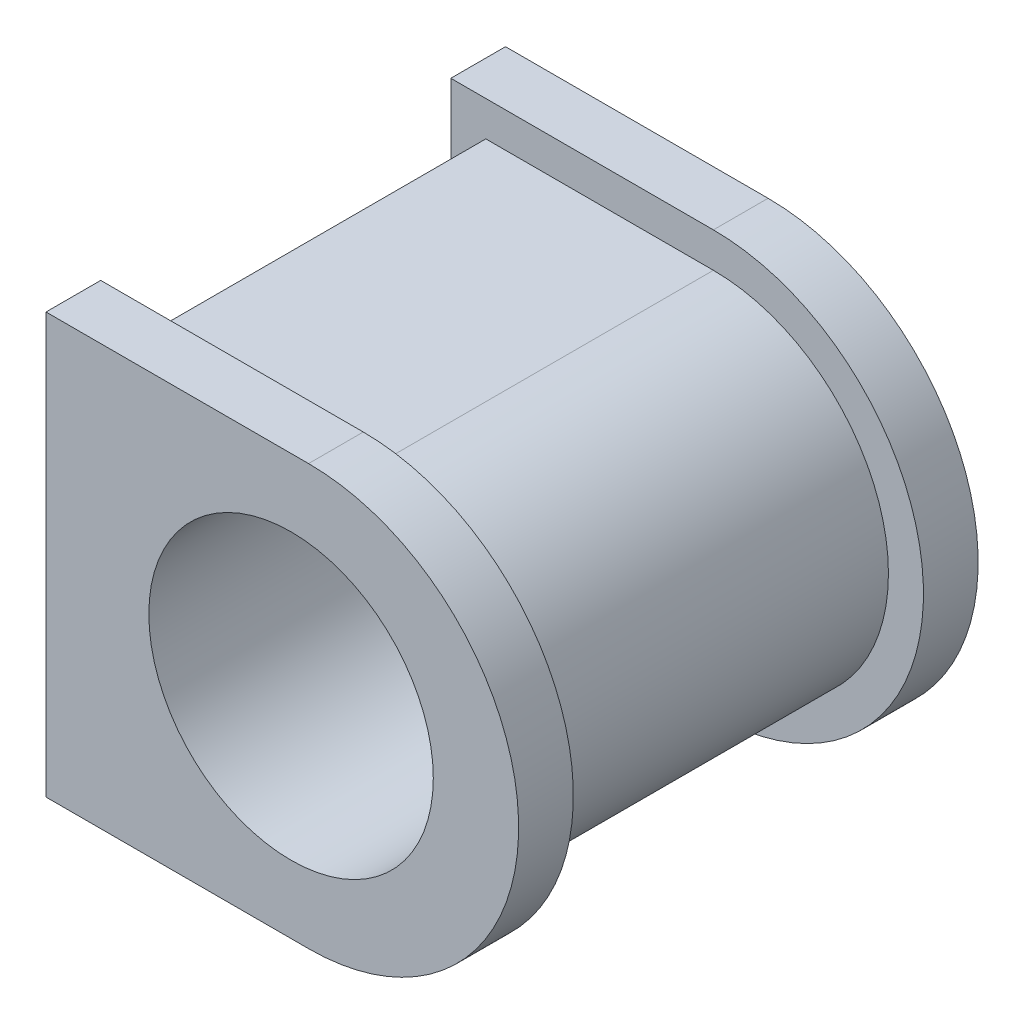
ISO-10303-21;
HEADER;
FILE_DESCRIPTION(('STEP AP214'),'2;1');
FILE_NAME('part.step','',(''),(''),'','','');
FILE_SCHEMA(('AUTOMOTIVE_DESIGN { 1 0 10303 214 1 1 1 1 }'));
ENDSEC;
DATA;
#1=APPLICATION_CONTEXT('core data for automotive mechanical design processes');
#2=APPLICATION_PROTOCOL_DEFINITION('international standard','automotive_design',2000,#1);
#3=PRODUCT_CONTEXT('',#1,'mechanical');
#4=PRODUCT('Part','Part','',(#3));
#5=PRODUCT_RELATED_PRODUCT_CATEGORY('part','',(#4));
#6=PRODUCT_DEFINITION_FORMATION('','',#4);
#7=PRODUCT_DEFINITION_CONTEXT('part definition',#1,'design');
#8=PRODUCT_DEFINITION('design','',#6,#7);
#9=PRODUCT_DEFINITION_SHAPE('','',#8);
#10=(LENGTH_UNIT() NAMED_UNIT(*) SI_UNIT(.MILLI.,.METRE.));
#11=(NAMED_UNIT(*) PLANE_ANGLE_UNIT() SI_UNIT($,.RADIAN.));
#12=(NAMED_UNIT(*) SI_UNIT($,.STERADIAN.) SOLID_ANGLE_UNIT());
#13=UNCERTAINTY_MEASURE_WITH_UNIT(LENGTH_MEASURE(1.E-05),#10,'distance_accuracy_value','');
#14=(GEOMETRIC_REPRESENTATION_CONTEXT(3) GLOBAL_UNCERTAINTY_ASSIGNED_CONTEXT((#13)) GLOBAL_UNIT_ASSIGNED_CONTEXT((#10,
#11,#12)) REPRESENTATION_CONTEXT('',''));
#15=CARTESIAN_POINT('',(0.,0.,0.));
#16=DIRECTION('',(0.,0.,1.));
#17=DIRECTION('',(1.,0.,0.));
#18=AXIS2_PLACEMENT_3D('',#15,#16,#17);
#19=CARTESIAN_POINT('',(-225.792643224085,137.875019839072,80.));
#20=DIRECTION('',(1.,0.,0.));
#21=DIRECTION('',(0.,0.,-1.));
#22=AXIS2_PLACEMENT_3D('',#19,#20,#21);
#23=PLANE('',#22);
#24=DIRECTION('',(0.,-1.,0.));
#25=VECTOR('',#24,1.);
#26=CARTESIAN_POINT('',(-225.792643224085,137.875019839072,0.));
#27=LINE('',#26,#25);
#28=CARTESIAN_POINT('',(-225.792643224085,137.875019839072,0.));
#29=VERTEX_POINT('',#28);
#30=CARTESIAN_POINT('',(-225.792643224085,57.8750198390718,0.));
#31=VERTEX_POINT('',#30);
#32=EDGE_CURVE('E184',#29,#31,#27,.T.);
#33=ORIENTED_EDGE('',*,*,#32,.T.);
#34=DIRECTION('',(0.,0.,-1.));
#35=VECTOR('',#34,1.);
#36=CARTESIAN_POINT('',(-225.792643224085,57.8750198390718,80.));
#37=LINE('',#36,#35);
#38=CARTESIAN_POINT('',(-225.792643224085,57.8750198390718,80.));
#39=VERTEX_POINT('',#38);
#40=EDGE_CURVE('E11',#39,#31,#37,.T.);
#41=ORIENTED_EDGE('',*,*,#40,.F.);
#42=DIRECTION('',(0.,-1.,0.));
#43=VECTOR('',#42,1.);
#44=CARTESIAN_POINT('',(-225.792643224085,137.875019839072,80.));
#45=LINE('',#44,#43);
#46=CARTESIAN_POINT('',(-225.792643224085,137.875019839072,80.));
#47=VERTEX_POINT('',#46);
#48=EDGE_CURVE('E185',#47,#39,#45,.T.);
#49=ORIENTED_EDGE('',*,*,#48,.F.);
#50=DIRECTION('',(0.,0.,-1.));
#51=VECTOR('',#50,1.);
#52=CARTESIAN_POINT('',(-225.792643224085,137.875019839072,80.));
#53=LINE('',#52,#51);
#54=EDGE_CURVE('E198',#47,#29,#53,.T.);
#55=ORIENTED_EDGE('',*,*,#54,.T.);
#56=EDGE_LOOP('',(#33,#41,#49,#55));
#57=FACE_BOUND('',#56,.T.);
#58=ADVANCED_FACE('F36',(#57),#23,.F.);
#59=CARTESIAN_POINT('',(-225.792643224085,57.8750198390718,80.));
#60=DIRECTION('',(0.,1.,0.));
#61=DIRECTION('',(0.,0.,1.));
#62=AXIS2_PLACEMENT_3D('',#59,#60,#61);
#63=PLANE('',#62);
#64=DIRECTION('',(1.,0.,0.));
#65=VECTOR('',#64,1.);
#66=CARTESIAN_POINT('',(-225.792643224085,57.8750198390718,0.));
#67=LINE('',#66,#65);
#68=CARTESIAN_POINT('',(-173.792643224085,57.8750198390718,0.));
#69=VERTEX_POINT('',#68);
#70=EDGE_CURVE('E201',#31,#69,#67,.T.);
#71=ORIENTED_EDGE('',*,*,#70,.T.);
#72=DIRECTION('',(0.,0.,-1.));
#73=VECTOR('',#72,1.);
#74=CARTESIAN_POINT('',(-173.792643224085,57.8750198390718,80.));
#75=LINE('',#74,#73);
#76=CARTESIAN_POINT('',(-173.792643224085,57.8750198390718,80.));
#77=VERTEX_POINT('',#76);
#78=EDGE_CURVE('E44',#77,#69,#75,.T.);
#79=ORIENTED_EDGE('',*,*,#78,.F.);
#80=DIRECTION('',(1.,0.,0.));
#81=VECTOR('',#80,1.);
#82=CARTESIAN_POINT('',(-225.792643224085,57.8750198390718,80.));
#83=LINE('',#82,#81);
#84=EDGE_CURVE('E188',#39,#77,#83,.T.);
#85=ORIENTED_EDGE('',*,*,#84,.F.);
#86=ORIENTED_EDGE('',*,*,#40,.T.);
#87=EDGE_LOOP('',(#71,#79,#85,#86));
#88=FACE_BOUND('',#87,.T.);
#89=ADVANCED_FACE('F214',(#88),#63,.F.);
#90=CARTESIAN_POINT('',(-173.792643224085,97.8750198390718,80.));
#91=DIRECTION('',(0.,0.,-1.));
#92=DIRECTION('',(-1.,0.,0.));
#93=AXIS2_PLACEMENT_3D('',#90,#91,#92);
#94=CYLINDRICAL_SURFACE('',#93,40.);
#95=CARTESIAN_POINT('',(-173.792643224085,97.8750198390718,0.));
#96=DIRECTION('',(0.,0.,1.));
#97=DIRECTION('',(1.,0.,0.));
#98=AXIS2_PLACEMENT_3D('',#95,#96,#97);
#99=CIRCLE('',#98,40.);
#100=CARTESIAN_POINT('',(-173.792643224085,137.875019839072,0.));
#101=VERTEX_POINT('',#100);
#102=EDGE_CURVE('E204',#69,#101,#99,.T.);
#103=ORIENTED_EDGE('',*,*,#102,.T.);
#104=DIRECTION('',(0.,0.,-1.));
#105=VECTOR('',#104,1.);
#106=CARTESIAN_POINT('',(-173.792643224085,137.875019839072,80.));
#107=LINE('',#106,#105);
#108=CARTESIAN_POINT('',(-173.792643224085,137.875019839072,80.));
#109=VERTEX_POINT('',#108);
#110=EDGE_CURVE('E51',#109,#101,#107,.T.);
#111=ORIENTED_EDGE('',*,*,#110,.F.);
#112=CARTESIAN_POINT('',(-173.792643224085,97.8750198390718,80.));
#113=DIRECTION('',(0.,0.,1.));
#114=DIRECTION('',(1.,0.,0.));
#115=AXIS2_PLACEMENT_3D('',#112,#113,#114);
#116=CIRCLE('',#115,40.);
#117=EDGE_CURVE('E192',#77,#109,#116,.T.);
#118=ORIENTED_EDGE('',*,*,#117,.F.);
#119=ORIENTED_EDGE('',*,*,#78,.T.);
#120=EDGE_LOOP('',(#103,#111,#118,#119));
#121=FACE_BOUND('',#120,.T.);
#122=ADVANCED_FACE('F211',(#121),#94,.T.);
#123=CARTESIAN_POINT('',(-225.792643224085,137.875019839072,80.));
#124=DIRECTION('',(0.,-1.,0.));
#125=DIRECTION('',(0.,0.,-1.));
#126=AXIS2_PLACEMENT_3D('',#123,#124,#125);
#127=PLANE('',#126);
#128=DIRECTION('',(-1.,0.,0.));
#129=VECTOR('',#128,1.);
#130=CARTESIAN_POINT('',(-225.792643224085,137.875019839072,0.));
#131=LINE('',#130,#129);
#132=EDGE_CURVE('E189',#101,#29,#131,.T.);
#133=ORIENTED_EDGE('',*,*,#132,.T.);
#134=ORIENTED_EDGE('',*,*,#54,.F.);
#135=DIRECTION('',(-1.,0.,0.));
#136=VECTOR('',#135,1.);
#137=CARTESIAN_POINT('',(-225.792643224085,137.875019839072,80.));
#138=LINE('',#137,#136);
#139=EDGE_CURVE('E195',#109,#47,#138,.T.);
#140=ORIENTED_EDGE('',*,*,#139,.F.);
#141=ORIENTED_EDGE('',*,*,#110,.T.);
#142=EDGE_LOOP('',(#133,#134,#140,#141));
#143=FACE_BOUND('',#142,.T.);
#144=ADVANCED_FACE('F221',(#143),#127,.F.);
#145=CARTESIAN_POINT('',(-177.792643224085,97.8750198390718,80.));
#146=DIRECTION('',(0.,0.,-1.));
#147=DIRECTION('',(-1.,0.,0.));
#148=AXIS2_PLACEMENT_3D('',#145,#146,#147);
#149=CYLINDRICAL_SURFACE('',#148,32.5);
#150=CARTESIAN_POINT('',(-177.792643224085,97.8750198390718,92.5));
#151=DIRECTION('',(0.,0.,1.));
#152=DIRECTION('',(1.,0.,0.));
#153=AXIS2_PLACEMENT_3D('',#150,#151,#152);
#154=CIRCLE('',#153,32.5);
#155=CARTESIAN_POINT('',(-145.292643224085,97.8750198390718,92.5));
#156=VERTEX_POINT('',#155);
#157=EDGE_CURVE('E166',#156,#156,#154,.F.);
#158=ORIENTED_EDGE('',*,*,#157,.F.);
#159=EDGE_LOOP('',(#158));
#160=FACE_BOUND('',#159,.T.);
#161=CARTESIAN_POINT('',(-177.792643224085,97.8750198390718,-12.5));
#162=DIRECTION('',(0.,0.,-1.));
#163=DIRECTION('',(-1.,0.,0.));
#164=AXIS2_PLACEMENT_3D('',#161,#162,#163);
#165=CIRCLE('',#164,32.5);
#166=CARTESIAN_POINT('',(-210.292643224085,97.8750198390718,-12.5));
#167=VERTEX_POINT('',#166);
#168=EDGE_CURVE('E282',#167,#167,#165,.T.);
#169=ORIENTED_EDGE('',*,*,#168,.T.);
#170=EDGE_LOOP('',(#169));
#171=FACE_BOUND('',#170,.T.);
#172=ADVANCED_FACE('F227',(#160,#171),#149,.F.);
#173=CARTESIAN_POINT('',(0.,0.,80.));
#174=DIRECTION('',(0.,0.,1.));
#175=DIRECTION('',(1.,0.,0.));
#176=AXIS2_PLACEMENT_3D('',#173,#174,#175);
#177=PLANE('',#176);
#178=DIRECTION('',(-1.,0.,0.));
#179=VECTOR('',#178,1.);
#180=CARTESIAN_POINT('',(0.,49.8750198390718,80.));
#181=LINE('',#180,#179);
#182=CARTESIAN_POINT('',(-173.792643224085,49.8750198390718,80.));
#183=VERTEX_POINT('',#182);
#184=CARTESIAN_POINT('',(-233.792643224085,49.8750198390718,80.));
#185=VERTEX_POINT('',#184);
#186=EDGE_CURVE('E147',#183,#185,#181,.T.);
#187=ORIENTED_EDGE('',*,*,#186,.T.);
#188=DIRECTION('',(0.,-1.,0.));
#189=VECTOR('',#188,1.);
#190=CARTESIAN_POINT('',(-233.792643224085,0.,80.));
#191=LINE('',#190,#189);
#192=CARTESIAN_POINT('',(-233.792643224085,145.875019839072,80.));
#193=VERTEX_POINT('',#192);
#194=EDGE_CURVE('E160',#193,#185,#191,.T.);
#195=ORIENTED_EDGE('',*,*,#194,.F.);
#196=DIRECTION('',(-1.,0.,0.));
#197=VECTOR('',#196,1.);
#198=CARTESIAN_POINT('',(0.,145.875019839072,80.));
#199=LINE('',#198,#197);
#200=CARTESIAN_POINT('',(-173.792643224085,145.875019839072,80.));
#201=VERTEX_POINT('',#200);
#202=EDGE_CURVE('E171',#201,#193,#199,.T.);
#203=ORIENTED_EDGE('',*,*,#202,.F.);
#204=CARTESIAN_POINT('',(-173.792643224085,97.8750198390718,80.));
#205=DIRECTION('',(0.,0.,1.));
#206=DIRECTION('',(1.,0.,0.));
#207=AXIS2_PLACEMENT_3D('',#204,#205,#206);
#208=CIRCLE('',#207,48.);
#209=EDGE_CURVE('E150',#183,#201,#208,.T.);
#210=ORIENTED_EDGE('',*,*,#209,.F.);
#211=EDGE_LOOP('',(#187,#195,#203,#210));
#212=FACE_BOUND('',#211,.T.);
#213=ORIENTED_EDGE('',*,*,#139,.T.);
#214=ORIENTED_EDGE('',*,*,#48,.T.);
#215=ORIENTED_EDGE('',*,*,#84,.T.);
#216=ORIENTED_EDGE('',*,*,#117,.T.);
#217=EDGE_LOOP('',(#213,#214,#215,#216));
#218=FACE_BOUND('',#217,.T.);
#219=ADVANCED_FACE('F224',(#212,#218),#177,.F.);
#220=CARTESIAN_POINT('',(0.,49.8750198390718,92.5));
#221=DIRECTION('',(0.,-1.,0.));
#222=DIRECTION('',(1.,0.,0.));
#223=AXIS2_PLACEMENT_3D('',#220,#221,#222);
#224=PLANE('',#223);
#225=ORIENTED_EDGE('',*,*,#186,.F.);
#226=DIRECTION('',(0.,0.,-1.));
#227=VECTOR('',#226,1.);
#228=CARTESIAN_POINT('',(-173.792643224085,49.8750198390718,92.5));
#229=LINE('',#228,#227);
#230=CARTESIAN_POINT('',(-173.792643224085,49.8750198390718,92.5));
#231=VERTEX_POINT('',#230);
#232=EDGE_CURVE('E182',#231,#183,#229,.T.);
#233=ORIENTED_EDGE('',*,*,#232,.F.);
#234=DIRECTION('',(-1.,0.,0.));
#235=VECTOR('',#234,1.);
#236=CARTESIAN_POINT('',(0.,49.8750198390718,92.5));
#237=LINE('',#236,#235);
#238=CARTESIAN_POINT('',(-233.792643224085,49.8750198390718,92.5));
#239=VERTEX_POINT('',#238);
#240=EDGE_CURVE('E156',#231,#239,#237,.T.);
#241=ORIENTED_EDGE('',*,*,#240,.T.);
#242=DIRECTION('',(0.,0.,-1.));
#243=VECTOR('',#242,1.);
#244=CARTESIAN_POINT('',(-233.792643224085,49.8750198390718,92.5));
#245=LINE('',#244,#243);
#246=EDGE_CURVE('E168',#239,#185,#245,.T.);
#247=ORIENTED_EDGE('',*,*,#246,.T.);
#248=EDGE_LOOP('',(#225,#233,#241,#247));
#249=FACE_BOUND('',#248,.T.);
#250=ADVANCED_FACE('F226',(#249),#224,.T.);
#251=CARTESIAN_POINT('',(-173.792643224085,97.8750198390718,92.5));
#252=DIRECTION('',(0.,0.,-1.));
#253=DIRECTION('',(-1.,0.,0.));
#254=AXIS2_PLACEMENT_3D('',#251,#252,#253);
#255=CYLINDRICAL_SURFACE('',#254,48.);
#256=ORIENTED_EDGE('',*,*,#209,.T.);
#257=DIRECTION('',(0.,0.,-1.));
#258=VECTOR('',#257,1.);
#259=CARTESIAN_POINT('',(-173.792643224085,145.875019839072,92.5));
#260=LINE('',#259,#258);
#261=CARTESIAN_POINT('',(-173.792643224085,145.875019839072,92.5));
#262=VERTEX_POINT('',#261);
#263=EDGE_CURVE('E179',#262,#201,#260,.T.);
#264=ORIENTED_EDGE('',*,*,#263,.F.);
#265=CARTESIAN_POINT('',(-173.792643224085,97.8750198390718,92.5));
#266=DIRECTION('',(0.,0.,1.));
#267=DIRECTION('',(1.,0.,0.));
#268=AXIS2_PLACEMENT_3D('',#265,#266,#267);
#269=CIRCLE('',#268,48.);
#270=EDGE_CURVE('E159',#231,#262,#269,.T.);
#271=ORIENTED_EDGE('',*,*,#270,.F.);
#272=ORIENTED_EDGE('',*,*,#232,.T.);
#273=EDGE_LOOP('',(#256,#264,#271,#272));
#274=FACE_BOUND('',#273,.T.);
#275=ADVANCED_FACE('F234',(#274),#255,.T.);
#276=CARTESIAN_POINT('',(0.,145.875019839072,92.5));
#277=DIRECTION('',(0.,-1.,0.));
#278=DIRECTION('',(1.,0.,0.));
#279=AXIS2_PLACEMENT_3D('',#276,#277,#278);
#280=PLANE('',#279);
#281=ORIENTED_EDGE('',*,*,#202,.T.);
#282=DIRECTION('',(0.,0.,-1.));
#283=VECTOR('',#282,1.);
#284=CARTESIAN_POINT('',(-233.792643224085,145.875019839072,92.5));
#285=LINE('',#284,#283);
#286=CARTESIAN_POINT('',(-233.792643224085,145.875019839072,92.5));
#287=VERTEX_POINT('',#286);
#288=EDGE_CURVE('E176',#287,#193,#285,.T.);
#289=ORIENTED_EDGE('',*,*,#288,.F.);
#290=DIRECTION('',(-1.,0.,0.));
#291=VECTOR('',#290,1.);
#292=CARTESIAN_POINT('',(0.,145.875019839072,92.5));
#293=LINE('',#292,#291);
#294=EDGE_CURVE('E162',#262,#287,#293,.T.);
#295=ORIENTED_EDGE('',*,*,#294,.F.);
#296=ORIENTED_EDGE('',*,*,#263,.T.);
#297=EDGE_LOOP('',(#281,#289,#295,#296));
#298=FACE_BOUND('',#297,.T.);
#299=ADVANCED_FACE('F254',(#298),#280,.F.);
#300=CARTESIAN_POINT('',(-233.792643224085,0.,92.5));
#301=DIRECTION('',(1.,0.,0.));
#302=DIRECTION('',(0.,0.,-1.));
#303=AXIS2_PLACEMENT_3D('',#300,#301,#302);
#304=PLANE('',#303);
#305=ORIENTED_EDGE('',*,*,#194,.T.);
#306=ORIENTED_EDGE('',*,*,#246,.F.);
#307=DIRECTION('',(0.,-1.,0.));
#308=VECTOR('',#307,1.);
#309=CARTESIAN_POINT('',(-233.792643224085,0.,92.5));
#310=LINE('',#309,#308);
#311=EDGE_CURVE('E164',#287,#239,#310,.T.);
#312=ORIENTED_EDGE('',*,*,#311,.F.);
#313=ORIENTED_EDGE('',*,*,#288,.T.);
#314=EDGE_LOOP('',(#305,#306,#312,#313));
#315=FACE_BOUND('',#314,.T.);
#316=ADVANCED_FACE('F257',(#315),#304,.F.);
#317=CARTESIAN_POINT('',(0.,0.,92.5));
#318=DIRECTION('',(0.,0.,1.));
#319=DIRECTION('',(1.,0.,0.));
#320=AXIS2_PLACEMENT_3D('',#317,#318,#319);
#321=PLANE('',#320);
#322=ORIENTED_EDGE('',*,*,#240,.F.);
#323=ORIENTED_EDGE('',*,*,#270,.T.);
#324=ORIENTED_EDGE('',*,*,#294,.T.);
#325=ORIENTED_EDGE('',*,*,#311,.T.);
#326=EDGE_LOOP('',(#322,#323,#324,#325));
#327=FACE_BOUND('',#326,.T.);
#328=ORIENTED_EDGE('',*,*,#157,.T.);
#329=EDGE_LOOP('',(#328));
#330=FACE_BOUND('',#329,.T.);
#331=ADVANCED_FACE('F260',(#327,#330),#321,.T.);
#332=CARTESIAN_POINT('',(-173.792643224085,97.8750198390718,-12.5));
#333=DIRECTION('',(0.,0.,-1.));
#334=DIRECTION('',(-1.,0.,0.));
#335=AXIS2_PLACEMENT_3D('',#332,#333,#334);
#336=PLANE('',#335);
#337=DIRECTION('',(0.,1.,0.));
#338=VECTOR('',#337,1.);
#339=CARTESIAN_POINT('',(-233.792643224085,145.875019839072,-12.5));
#340=LINE('',#339,#338);
#341=CARTESIAN_POINT('',(-233.792643224085,49.8750198390718,-12.5));
#342=VERTEX_POINT('',#341);
#343=CARTESIAN_POINT('',(-233.792643224085,145.875019839072,-12.5));
#344=VERTEX_POINT('',#343);
#345=EDGE_CURVE('E132',#342,#344,#340,.T.);
#346=ORIENTED_EDGE('',*,*,#345,.T.);
#347=DIRECTION('',(1.,0.,0.));
#348=VECTOR('',#347,1.);
#349=CARTESIAN_POINT('',(-233.792643224085,145.875019839072,-12.5));
#350=LINE('',#349,#348);
#351=CARTESIAN_POINT('',(-173.792643224085,145.875019839072,-12.5));
#352=VERTEX_POINT('',#351);
#353=EDGE_CURVE('E121',#344,#352,#350,.T.);
#354=ORIENTED_EDGE('',*,*,#353,.T.);
#355=CARTESIAN_POINT('',(-173.792643224085,97.8750198390718,-12.5));
#356=DIRECTION('',(0.,0.,-1.));
#357=DIRECTION('',(-1.,0.,0.));
#358=AXIS2_PLACEMENT_3D('',#355,#356,#357);
#359=CIRCLE('',#358,48.);
#360=CARTESIAN_POINT('',(-173.792643224085,49.8750198390718,-12.5));
#361=VERTEX_POINT('',#360);
#362=EDGE_CURVE('E131',#352,#361,#359,.T.);
#363=ORIENTED_EDGE('',*,*,#362,.T.);
#364=DIRECTION('',(-1.,0.,0.));
#365=VECTOR('',#364,1.);
#366=CARTESIAN_POINT('',(-233.792643224085,49.8750198390718,-12.5));
#367=LINE('',#366,#365);
#368=EDGE_CURVE('E138',#361,#342,#367,.T.);
#369=ORIENTED_EDGE('',*,*,#368,.T.);
#370=EDGE_LOOP('',(#346,#354,#363,#369));
#371=FACE_BOUND('',#370,.T.);
#372=ORIENTED_EDGE('',*,*,#168,.F.);
#373=EDGE_LOOP('',(#372));
#374=FACE_BOUND('',#373,.T.);
#375=ADVANCED_FACE('F135',(#371,#374),#336,.T.);
#376=CARTESIAN_POINT('',(-173.792643224085,97.8750198390718,0.));
#377=DIRECTION('',(0.,0.,-1.));
#378=DIRECTION('',(-1.,0.,0.));
#379=AXIS2_PLACEMENT_3D('',#376,#377,#378);
#380=PLANE('',#379);
#381=ORIENTED_EDGE('',*,*,#32,.F.);
#382=ORIENTED_EDGE('',*,*,#132,.F.);
#383=ORIENTED_EDGE('',*,*,#102,.F.);
#384=ORIENTED_EDGE('',*,*,#70,.F.);
#385=EDGE_LOOP('',(#381,#382,#383,#384));
#386=FACE_BOUND('',#385,.T.);
#387=DIRECTION('',(0.,1.,0.));
#388=VECTOR('',#387,1.);
#389=CARTESIAN_POINT('',(-233.792643224085,145.875019839072,0.));
#390=LINE('',#389,#388);
#391=CARTESIAN_POINT('',(-233.792643224085,49.8750198390718,0.));
#392=VERTEX_POINT('',#391);
#393=CARTESIAN_POINT('',(-233.792643224085,145.875019839072,0.));
#394=VERTEX_POINT('',#393);
#395=EDGE_CURVE('E146',#392,#394,#390,.T.);
#396=ORIENTED_EDGE('',*,*,#395,.F.);
#397=DIRECTION('',(-1.,0.,0.));
#398=VECTOR('',#397,1.);
#399=CARTESIAN_POINT('',(-233.792643224085,49.8750198390718,0.));
#400=LINE('',#399,#398);
#401=CARTESIAN_POINT('',(-173.792643224085,49.8750198390718,0.));
#402=VERTEX_POINT('',#401);
#403=EDGE_CURVE('E142',#402,#392,#400,.T.);
#404=ORIENTED_EDGE('',*,*,#403,.F.);
#405=CARTESIAN_POINT('',(-173.792643224085,97.8750198390718,0.));
#406=DIRECTION('',(0.,0.,-1.));
#407=DIRECTION('',(-1.,0.,0.));
#408=AXIS2_PLACEMENT_3D('',#405,#406,#407);
#409=CIRCLE('',#408,48.);
#410=CARTESIAN_POINT('',(-173.792643224085,145.875019839072,0.));
#411=VERTEX_POINT('',#410);
#412=EDGE_CURVE('E291',#411,#402,#409,.T.);
#413=ORIENTED_EDGE('',*,*,#412,.F.);
#414=DIRECTION('',(1.,0.,0.));
#415=VECTOR('',#414,1.);
#416=CARTESIAN_POINT('',(-233.792643224085,145.875019839072,0.));
#417=LINE('',#416,#415);
#418=EDGE_CURVE('E284',#394,#411,#417,.T.);
#419=ORIENTED_EDGE('',*,*,#418,.F.);
#420=EDGE_LOOP('',(#396,#404,#413,#419));
#421=FACE_BOUND('',#420,.T.);
#422=ADVANCED_FACE('F217',(#386,#421),#380,.F.);
#423=CARTESIAN_POINT('',(-233.792643224085,145.875019839072,-12.5));
#424=DIRECTION('',(1.,0.,0.));
#425=DIRECTION('',(0.,0.,-1.));
#426=AXIS2_PLACEMENT_3D('',#423,#424,#425);
#427=PLANE('',#426);
#428=ORIENTED_EDGE('',*,*,#395,.T.);
#429=DIRECTION('',(0.,0.,1.));
#430=VECTOR('',#429,1.);
#431=CARTESIAN_POINT('',(-233.792643224085,145.875019839072,-12.5));
#432=LINE('',#431,#430);
#433=EDGE_CURVE('E125',#344,#394,#432,.T.);
#434=ORIENTED_EDGE('',*,*,#433,.F.);
#435=ORIENTED_EDGE('',*,*,#345,.F.);
#436=DIRECTION('',(0.,0.,1.));
#437=VECTOR('',#436,1.);
#438=CARTESIAN_POINT('',(-233.792643224085,49.8750198390718,-12.5));
#439=LINE('',#438,#437);
#440=EDGE_CURVE('E288',#342,#392,#439,.T.);
#441=ORIENTED_EDGE('',*,*,#440,.T.);
#442=EDGE_LOOP('',(#428,#434,#435,#441));
#443=FACE_BOUND('',#442,.T.);
#444=ADVANCED_FACE('F144',(#443),#427,.F.);
#445=CARTESIAN_POINT('',(-233.792643224085,145.875019839072,-12.5));
#446=DIRECTION('',(0.,-1.,0.));
#447=DIRECTION('',(1.,0.,0.));
#448=AXIS2_PLACEMENT_3D('',#445,#446,#447);
#449=PLANE('',#448);
#450=ORIENTED_EDGE('',*,*,#418,.T.);
#451=DIRECTION('',(0.,0.,1.));
#452=VECTOR('',#451,1.);
#453=CARTESIAN_POINT('',(-173.792643224085,145.875019839072,-12.5));
#454=LINE('',#453,#452);
#455=EDGE_CURVE('E128',#352,#411,#454,.T.);
#456=ORIENTED_EDGE('',*,*,#455,.F.);
#457=ORIENTED_EDGE('',*,*,#353,.F.);
#458=ORIENTED_EDGE('',*,*,#433,.T.);
#459=EDGE_LOOP('',(#450,#456,#457,#458));
#460=FACE_BOUND('',#459,.T.);
#461=ADVANCED_FACE('F123',(#460),#449,.F.);
#462=CARTESIAN_POINT('',(-173.792643224085,97.8750198390718,-12.5));
#463=DIRECTION('',(0.,0.,1.));
#464=DIRECTION('',(1.,0.,0.));
#465=AXIS2_PLACEMENT_3D('',#462,#463,#464);
#466=CYLINDRICAL_SURFACE('',#465,48.);
#467=ORIENTED_EDGE('',*,*,#412,.T.);
#468=DIRECTION('',(0.,0.,1.));
#469=VECTOR('',#468,1.);
#470=CARTESIAN_POINT('',(-173.792643224085,49.8750198390718,-12.5));
#471=LINE('',#470,#469);
#472=EDGE_CURVE('E152',#361,#402,#471,.T.);
#473=ORIENTED_EDGE('',*,*,#472,.F.);
#474=ORIENTED_EDGE('',*,*,#362,.F.);
#475=ORIENTED_EDGE('',*,*,#455,.T.);
#476=EDGE_LOOP('',(#467,#473,#474,#475));
#477=FACE_BOUND('',#476,.T.);
#478=ADVANCED_FACE('F301',(#477),#466,.T.);
#479=CARTESIAN_POINT('',(-233.792643224085,49.8750198390718,-12.5));
#480=DIRECTION('',(0.,1.,0.));
#481=DIRECTION('',(-1.,0.,0.));
#482=AXIS2_PLACEMENT_3D('',#479,#480,#481);
#483=PLANE('',#482);
#484=ORIENTED_EDGE('',*,*,#403,.T.);
#485=ORIENTED_EDGE('',*,*,#440,.F.);
#486=ORIENTED_EDGE('',*,*,#368,.F.);
#487=ORIENTED_EDGE('',*,*,#472,.T.);
#488=EDGE_LOOP('',(#484,#485,#486,#487));
#489=FACE_BOUND('',#488,.T.);
#490=ADVANCED_FACE('F298',(#489),#483,.F.);
#491=CLOSED_SHELL('',(#58,#89,#122,#144,#172,#219,#250,#275,#299,#316,#331,#375,#422,#444,#461,
#478,#490));
#492=MANIFOLD_SOLID_BREP('B2',#491);
#493=ADVANCED_BREP_SHAPE_REPRESENTATION('',(#18,#492),#14);
#494=SHAPE_DEFINITION_REPRESENTATION(#9,#493);
ENDSEC;
END-ISO-10303-21;
